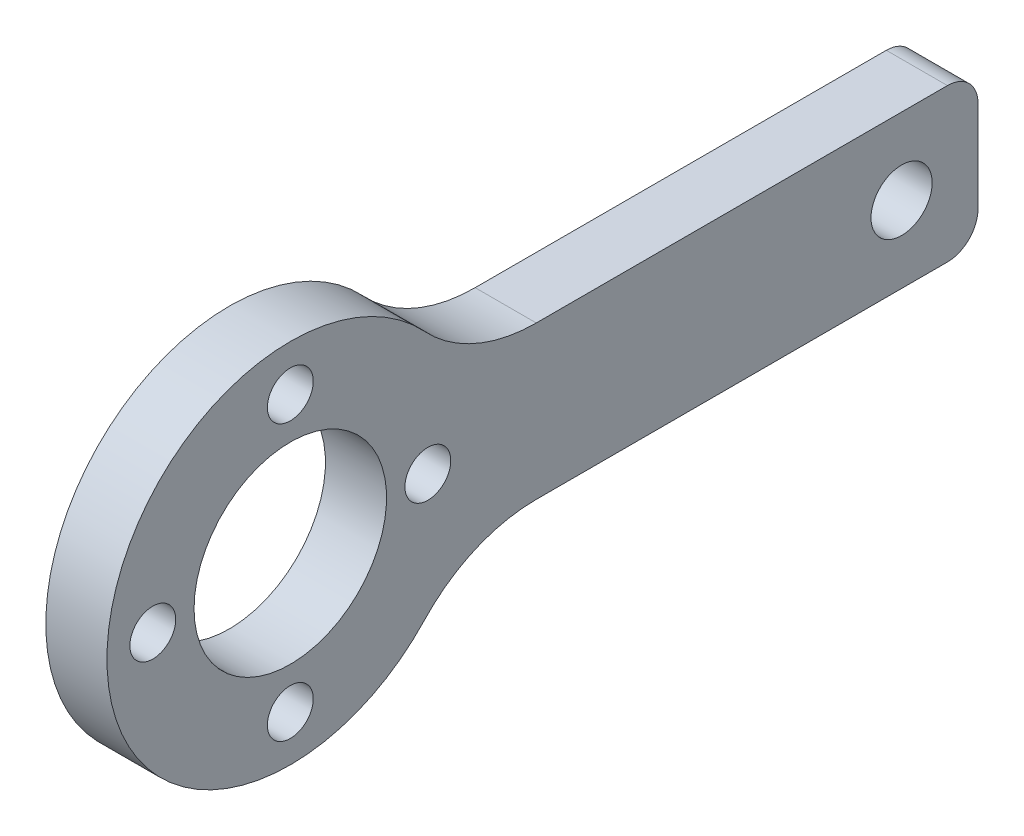
ISO-10303-21;
HEADER;
FILE_DESCRIPTION(('STEP AP214'),'2;1');
FILE_NAME('part.step','',(''),(''),'','','');
FILE_SCHEMA(('AUTOMOTIVE_DESIGN { 1 0 10303 214 1 1 1 1 }'));
ENDSEC;
DATA;
#1=APPLICATION_CONTEXT('core data for automotive mechanical design processes');
#2=APPLICATION_PROTOCOL_DEFINITION('international standard','automotive_design',2000,#1);
#3=PRODUCT_CONTEXT('',#1,'mechanical');
#4=PRODUCT('Part','Part','',(#3));
#5=PRODUCT_RELATED_PRODUCT_CATEGORY('part','',(#4));
#6=PRODUCT_DEFINITION_FORMATION('','',#4);
#7=PRODUCT_DEFINITION_CONTEXT('part definition',#1,'design');
#8=PRODUCT_DEFINITION('design','',#6,#7);
#9=PRODUCT_DEFINITION_SHAPE('','',#8);
#10=(LENGTH_UNIT() NAMED_UNIT(*) SI_UNIT(.MILLI.,.METRE.));
#11=(NAMED_UNIT(*) PLANE_ANGLE_UNIT() SI_UNIT($,.RADIAN.));
#12=(NAMED_UNIT(*) SI_UNIT($,.STERADIAN.) SOLID_ANGLE_UNIT());
#13=UNCERTAINTY_MEASURE_WITH_UNIT(LENGTH_MEASURE(1.E-05),#10,'distance_accuracy_value','');
#14=(GEOMETRIC_REPRESENTATION_CONTEXT(3) GLOBAL_UNCERTAINTY_ASSIGNED_CONTEXT((#13)) GLOBAL_UNIT_ASSIGNED_CONTEXT((#10,
#11,#12)) REPRESENTATION_CONTEXT('',''));
#15=CARTESIAN_POINT('',(0.,0.,0.));
#16=DIRECTION('',(0.,0.,1.));
#17=DIRECTION('',(1.,0.,0.));
#18=AXIS2_PLACEMENT_3D('',#15,#16,#17);
#19=CARTESIAN_POINT('',(4.,0.,0.));
#20=DIRECTION('',(1.,0.,0.));
#21=DIRECTION('',(0.,0.,1.));
#22=AXIS2_PLACEMENT_3D('',#19,#20,#21);
#23=PLANE('',#22);
#24=CARTESIAN_POINT('',(4.,0.,0.));
#25=DIRECTION('',(-1.,0.,0.));
#26=DIRECTION('',(0.,0.,1.));
#27=AXIS2_PLACEMENT_3D('',#24,#25,#26);
#28=CIRCLE('',#27,6.3);
#29=CARTESIAN_POINT('',(4.,0.,6.3));
#30=VERTEX_POINT('',#29);
#31=EDGE_CURVE('E205',#30,#30,#28,.T.);
#32=ORIENTED_EDGE('',*,*,#31,.T.);
#33=EDGE_LOOP('',(#32));
#34=FACE_BOUND('',#33,.T.);
#35=DIRECTION('',(0.,-1.,0.));
#36=VECTOR('',#35,1.);
#37=CARTESIAN_POINT('',(4.,-5.,-45.));
#38=LINE('',#37,#36);
#39=CARTESIAN_POINT('',(4.,3.,-45.));
#40=VERTEX_POINT('',#39);
#41=CARTESIAN_POINT('',(4.,-3.,-45.));
#42=VERTEX_POINT('',#41);
#43=EDGE_CURVE('E180',#40,#42,#38,.T.);
#44=ORIENTED_EDGE('',*,*,#43,.F.);
#45=CARTESIAN_POINT('',(4.,3.,-43.));
#46=DIRECTION('',(-1.,0.,0.));
#47=DIRECTION('',(0.,0.,1.));
#48=AXIS2_PLACEMENT_3D('',#45,#46,#47);
#49=CIRCLE('',#48,2.);
#50=CARTESIAN_POINT('',(4.,5.,-43.));
#51=VERTEX_POINT('',#50);
#52=EDGE_CURVE('E149',#51,#40,#49,.T.);
#53=ORIENTED_EDGE('',*,*,#52,.F.);
#54=DIRECTION('',(0.,0.,-1.));
#55=VECTOR('',#54,1.);
#56=CARTESIAN_POINT('',(4.,5.,-45.));
#57=LINE('',#56,#55);
#58=CARTESIAN_POINT('',(4.,5.,-16.0934769394311));
#59=VERTEX_POINT('',#58);
#60=EDGE_CURVE('E174',#59,#51,#57,.T.);
#61=ORIENTED_EDGE('',*,*,#60,.F.);
#62=CARTESIAN_POINT('',(4.,15.,-16.0934769394311));
#63=DIRECTION('',(-1.,0.,0.));
#64=DIRECTION('',(0.,0.,1.));
#65=AXIS2_PLACEMENT_3D('',#62,#63,#64);
#66=CIRCLE('',#65,10.);
#67=CARTESIAN_POINT('',(4.,8.18181818181818,-8.77826014878059));
#68=VERTEX_POINT('',#67);
#69=EDGE_CURVE('E122',#68,#59,#66,.F.);
#70=ORIENTED_EDGE('',*,*,#69,.F.);
#71=CARTESIAN_POINT('',(4.,0.,0.));
#72=DIRECTION('',(-1.,0.,0.));
#73=DIRECTION('',(0.,0.,1.));
#74=AXIS2_PLACEMENT_3D('',#71,#72,#73);
#75=CIRCLE('',#74,12.);
#76=CARTESIAN_POINT('',(4.,-8.18181818181818,-8.77826014878059));
#77=VERTEX_POINT('',#76);
#78=EDGE_CURVE('E106',#77,#68,#75,.T.);
#79=ORIENTED_EDGE('',*,*,#78,.F.);
#80=CARTESIAN_POINT('',(4.,-15.,-16.0934769394311));
#81=DIRECTION('',(-1.,0.,0.));
#82=DIRECTION('',(0.,0.,1.));
#83=AXIS2_PLACEMENT_3D('',#80,#81,#82);
#84=CIRCLE('',#83,10.);
#85=CARTESIAN_POINT('',(4.,-5.,-16.0934769394311));
#86=VERTEX_POINT('',#85);
#87=EDGE_CURVE('E117',#86,#77,#84,.F.);
#88=ORIENTED_EDGE('',*,*,#87,.F.);
#89=DIRECTION('',(0.,0.,1.));
#90=VECTOR('',#89,1.);
#91=CARTESIAN_POINT('',(4.,-5.,-45.));
#92=LINE('',#91,#90);
#93=CARTESIAN_POINT('',(4.,-5.,-43.));
#94=VERTEX_POINT('',#93);
#95=EDGE_CURVE('E183',#94,#86,#92,.T.);
#96=ORIENTED_EDGE('',*,*,#95,.F.);
#97=CARTESIAN_POINT('',(4.,-3.,-43.));
#98=DIRECTION('',(-1.,0.,0.));
#99=DIRECTION('',(0.,0.,1.));
#100=AXIS2_PLACEMENT_3D('',#97,#98,#99);
#101=CIRCLE('',#100,2.);
#102=EDGE_CURVE('E152',#42,#94,#101,.T.);
#103=ORIENTED_EDGE('',*,*,#102,.F.);
#104=EDGE_LOOP('',(#44,#53,#61,#70,#79,#88,#96,#103));
#105=FACE_BOUND('',#104,.T.);
#106=CARTESIAN_POINT('',(4.,-9.,-1.8995222061946E-13));
#107=DIRECTION('',(-1.,0.,0.));
#108=DIRECTION('',(0.,0.,1.));
#109=AXIS2_PLACEMENT_3D('',#106,#107,#108);
#110=CIRCLE('',#109,1.5);
#111=CARTESIAN_POINT('',(4.,-9.,1.49999999999981));
#112=VERTEX_POINT('',#111);
#113=EDGE_CURVE('E193',#112,#112,#110,.T.);
#114=ORIENTED_EDGE('',*,*,#113,.T.);
#115=EDGE_LOOP('',(#114));
#116=FACE_BOUND('',#115,.T.);
#117=CARTESIAN_POINT('',(4.,9.,0.));
#118=DIRECTION('',(-1.,0.,0.));
#119=DIRECTION('',(0.,0.,1.));
#120=AXIS2_PLACEMENT_3D('',#117,#118,#119);
#121=CIRCLE('',#120,1.5);
#122=CARTESIAN_POINT('',(4.,9.,1.5));
#123=VERTEX_POINT('',#122);
#124=EDGE_CURVE('E131',#123,#123,#121,.T.);
#125=ORIENTED_EDGE('',*,*,#124,.T.);
#126=EDGE_LOOP('',(#125));
#127=FACE_BOUND('',#126,.T.);
#128=CARTESIAN_POINT('',(4.,-1.61329283265843E-13,9.));
#129=DIRECTION('',(-1.,0.,0.));
#130=DIRECTION('',(0.,0.,1.));
#131=AXIS2_PLACEMENT_3D('',#128,#129,#130);
#132=CIRCLE('',#131,1.5);
#133=CARTESIAN_POINT('',(4.,-1.61329283265843E-13,10.5));
#134=VERTEX_POINT('',#133);
#135=EDGE_CURVE('E199',#134,#134,#132,.T.);
#136=ORIENTED_EDGE('',*,*,#135,.T.);
#137=EDGE_LOOP('',(#136));
#138=FACE_BOUND('',#137,.T.);
#139=CARTESIAN_POINT('',(4.,2.21610924056037E-13,-9.));
#140=DIRECTION('',(-1.,0.,0.));
#141=DIRECTION('',(0.,0.,1.));
#142=AXIS2_PLACEMENT_3D('',#139,#140,#141);
#143=CIRCLE('',#142,1.5);
#144=CARTESIAN_POINT('',(4.,2.21610924056037E-13,-7.5));
#145=VERTEX_POINT('',#144);
#146=EDGE_CURVE('E186',#145,#145,#143,.T.);
#147=ORIENTED_EDGE('',*,*,#146,.T.);
#148=EDGE_LOOP('',(#147));
#149=FACE_BOUND('',#148,.T.);
#150=CARTESIAN_POINT('',(4.,0.,-40.));
#151=DIRECTION('',(-1.,0.,0.));
#152=DIRECTION('',(0.,0.,1.));
#153=AXIS2_PLACEMENT_3D('',#150,#151,#152);
#154=CIRCLE('',#153,2.);
#155=CARTESIAN_POINT('',(4.,0.,-38.));
#156=VERTEX_POINT('',#155);
#157=EDGE_CURVE('E177',#156,#156,#154,.T.);
#158=ORIENTED_EDGE('',*,*,#157,.T.);
#159=EDGE_LOOP('',(#158));
#160=FACE_BOUND('',#159,.T.);
#161=ADVANCED_FACE('F37',(#34,#105,#116,#127,#138,#149,#160),#23,.T.);
#162=CARTESIAN_POINT('',(0.,0.,0.));
#163=DIRECTION('',(1.,0.,0.));
#164=DIRECTION('',(0.,0.,1.));
#165=AXIS2_PLACEMENT_3D('',#162,#163,#164);
#166=PLANE('',#165);
#167=CARTESIAN_POINT('',(0.,0.,0.));
#168=DIRECTION('',(-1.,0.,0.));
#169=DIRECTION('',(0.,0.,1.));
#170=AXIS2_PLACEMENT_3D('',#167,#168,#169);
#171=CIRCLE('',#170,6.3);
#172=CARTESIAN_POINT('',(0.,0.,6.3));
#173=VERTEX_POINT('',#172);
#174=EDGE_CURVE('E202',#173,#173,#171,.T.);
#175=ORIENTED_EDGE('',*,*,#174,.F.);
#176=EDGE_LOOP('',(#175));
#177=FACE_BOUND('',#176,.T.);
#178=CARTESIAN_POINT('',(0.,9.,0.));
#179=DIRECTION('',(-1.,0.,0.));
#180=DIRECTION('',(0.,0.,1.));
#181=AXIS2_PLACEMENT_3D('',#178,#179,#180);
#182=CIRCLE('',#181,1.5);
#183=CARTESIAN_POINT('',(0.,9.,1.5));
#184=VERTEX_POINT('',#183);
#185=EDGE_CURVE('E134',#184,#184,#182,.T.);
#186=ORIENTED_EDGE('',*,*,#185,.F.);
#187=EDGE_LOOP('',(#186));
#188=FACE_BOUND('',#187,.T.);
#189=DIRECTION('',(0.,0.,-1.));
#190=VECTOR('',#189,1.);
#191=CARTESIAN_POINT('',(0.,-5.,-45.));
#192=LINE('',#191,#190);
#193=CARTESIAN_POINT('',(0.,-5.,-16.0934769394311));
#194=VERTEX_POINT('',#193);
#195=CARTESIAN_POINT('',(0.,-5.,-43.));
#196=VERTEX_POINT('',#195);
#197=EDGE_CURVE('E169',#194,#196,#192,.T.);
#198=ORIENTED_EDGE('',*,*,#197,.F.);
#199=CARTESIAN_POINT('',(0.,-15.,-16.0934769394311));
#200=DIRECTION('',(-1.,0.,0.));
#201=DIRECTION('',(0.,0.,1.));
#202=AXIS2_PLACEMENT_3D('',#199,#200,#201);
#203=CIRCLE('',#202,10.);
#204=CARTESIAN_POINT('',(0.,-8.18181818181818,-8.77826014878059));
#205=VERTEX_POINT('',#204);
#206=EDGE_CURVE('E123',#205,#194,#203,.T.);
#207=ORIENTED_EDGE('',*,*,#206,.F.);
#208=CARTESIAN_POINT('',(0.,0.,0.));
#209=DIRECTION('',(-1.,0.,0.));
#210=DIRECTION('',(0.,0.,1.));
#211=AXIS2_PLACEMENT_3D('',#208,#209,#210);
#212=CIRCLE('',#211,12.);
#213=CARTESIAN_POINT('',(0.,8.18181818181818,-8.77826014878059));
#214=VERTEX_POINT('',#213);
#215=EDGE_CURVE('E109',#205,#214,#212,.T.);
#216=ORIENTED_EDGE('',*,*,#215,.T.);
#217=CARTESIAN_POINT('',(0.,15.,-16.0934769394311));
#218=DIRECTION('',(-1.,0.,0.));
#219=DIRECTION('',(0.,0.,1.));
#220=AXIS2_PLACEMENT_3D('',#217,#218,#219);
#221=CIRCLE('',#220,10.);
#222=CARTESIAN_POINT('',(0.,5.,-16.0934769394311));
#223=VERTEX_POINT('',#222);
#224=EDGE_CURVE('E142',#223,#214,#221,.T.);
#225=ORIENTED_EDGE('',*,*,#224,.F.);
#226=DIRECTION('',(0.,0.,1.));
#227=VECTOR('',#226,1.);
#228=CARTESIAN_POINT('',(0.,5.,-45.));
#229=LINE('',#228,#227);
#230=CARTESIAN_POINT('',(0.,5.,-43.));
#231=VERTEX_POINT('',#230);
#232=EDGE_CURVE('E170',#231,#223,#229,.T.);
#233=ORIENTED_EDGE('',*,*,#232,.F.);
#234=CARTESIAN_POINT('',(0.,3.,-43.));
#235=DIRECTION('',(-1.,0.,0.));
#236=DIRECTION('',(0.,0.,1.));
#237=AXIS2_PLACEMENT_3D('',#234,#235,#236);
#238=CIRCLE('',#237,2.);
#239=CARTESIAN_POINT('',(0.,3.,-45.));
#240=VERTEX_POINT('',#239);
#241=EDGE_CURVE('E155',#240,#231,#238,.F.);
#242=ORIENTED_EDGE('',*,*,#241,.F.);
#243=DIRECTION('',(0.,1.,0.));
#244=VECTOR('',#243,1.);
#245=CARTESIAN_POINT('',(0.,-5.,-45.));
#246=LINE('',#245,#244);
#247=CARTESIAN_POINT('',(0.,-3.,-45.));
#248=VERTEX_POINT('',#247);
#249=EDGE_CURVE('E164',#248,#240,#246,.T.);
#250=ORIENTED_EDGE('',*,*,#249,.F.);
#251=CARTESIAN_POINT('',(0.,-3.,-43.));
#252=DIRECTION('',(-1.,0.,0.));
#253=DIRECTION('',(0.,0.,1.));
#254=AXIS2_PLACEMENT_3D('',#251,#252,#253);
#255=CIRCLE('',#254,2.);
#256=EDGE_CURVE('E45',#196,#248,#255,.F.);
#257=ORIENTED_EDGE('',*,*,#256,.F.);
#258=EDGE_LOOP('',(#198,#207,#216,#225,#233,#242,#250,#257));
#259=FACE_BOUND('',#258,.T.);
#260=CARTESIAN_POINT('',(0.,-1.61329283265843E-13,9.));
#261=DIRECTION('',(-1.,0.,0.));
#262=DIRECTION('',(0.,0.,1.));
#263=AXIS2_PLACEMENT_3D('',#260,#261,#262);
#264=CIRCLE('',#263,1.5);
#265=CARTESIAN_POINT('',(0.,-1.61329283265843E-13,10.5));
#266=VERTEX_POINT('',#265);
#267=EDGE_CURVE('E196',#266,#266,#264,.T.);
#268=ORIENTED_EDGE('',*,*,#267,.F.);
#269=EDGE_LOOP('',(#268));
#270=FACE_BOUND('',#269,.T.);
#271=CARTESIAN_POINT('',(0.,-9.,-1.8995222061946E-13));
#272=DIRECTION('',(-1.,0.,0.));
#273=DIRECTION('',(0.,0.,1.));
#274=AXIS2_PLACEMENT_3D('',#271,#272,#273);
#275=CIRCLE('',#274,1.5);
#276=CARTESIAN_POINT('',(0.,-9.,1.49999999999981));
#277=VERTEX_POINT('',#276);
#278=EDGE_CURVE('E189',#277,#277,#275,.T.);
#279=ORIENTED_EDGE('',*,*,#278,.F.);
#280=EDGE_LOOP('',(#279));
#281=FACE_BOUND('',#280,.T.);
#282=CARTESIAN_POINT('',(0.,2.21610924056037E-13,-9.));
#283=DIRECTION('',(-1.,0.,0.));
#284=DIRECTION('',(0.,0.,1.));
#285=AXIS2_PLACEMENT_3D('',#282,#283,#284);
#286=CIRCLE('',#285,1.5);
#287=CARTESIAN_POINT('',(0.,2.21610924056037E-13,-7.5));
#288=VERTEX_POINT('',#287);
#289=EDGE_CURVE('E190',#288,#288,#286,.T.);
#290=ORIENTED_EDGE('',*,*,#289,.F.);
#291=EDGE_LOOP('',(#290));
#292=FACE_BOUND('',#291,.T.);
#293=CARTESIAN_POINT('',(0.,0.,-40.));
#294=DIRECTION('',(-1.,0.,0.));
#295=DIRECTION('',(0.,0.,1.));
#296=AXIS2_PLACEMENT_3D('',#293,#294,#295);
#297=CIRCLE('',#296,2.);
#298=CARTESIAN_POINT('',(0.,0.,-38.));
#299=VERTEX_POINT('',#298);
#300=EDGE_CURVE('E172',#299,#299,#297,.F.);
#301=ORIENTED_EDGE('',*,*,#300,.T.);
#302=EDGE_LOOP('',(#301));
#303=FACE_BOUND('',#302,.T.);
#304=ADVANCED_FACE('F165',(#177,#188,#259,#270,#281,#292,#303),#166,.F.);
#305=CARTESIAN_POINT('',(4.,0.,0.));
#306=DIRECTION('',(-1.,0.,0.));
#307=DIRECTION('',(0.,0.,-1.));
#308=AXIS2_PLACEMENT_3D('',#305,#306,#307);
#309=CYLINDRICAL_SURFACE('',#308,12.);
#310=ORIENTED_EDGE('',*,*,#78,.T.);
#311=DIRECTION('',(-1.,0.,0.));
#312=VECTOR('',#311,1.);
#313=CARTESIAN_POINT('',(4.,8.18181818181818,-8.77826014878059));
#314=LINE('',#313,#312);
#315=EDGE_CURVE('E114',#214,#68,#314,.F.);
#316=ORIENTED_EDGE('',*,*,#315,.F.);
#317=ORIENTED_EDGE('',*,*,#215,.F.);
#318=DIRECTION('',(-1.,0.,0.));
#319=VECTOR('',#318,1.);
#320=CARTESIAN_POINT('',(4.,-8.18181818181818,-8.77826014878059));
#321=LINE('',#320,#319);
#322=EDGE_CURVE('E102',#77,#205,#321,.T.);
#323=ORIENTED_EDGE('',*,*,#322,.F.);
#324=EDGE_LOOP('',(#310,#316,#317,#323));
#325=FACE_BOUND('',#324,.T.);
#326=ADVANCED_FACE('F104',(#325),#309,.T.);
#327=CARTESIAN_POINT('',(4.,9.,0.));
#328=DIRECTION('',(-1.,0.,0.));
#329=DIRECTION('',(0.,0.,-1.));
#330=AXIS2_PLACEMENT_3D('',#327,#328,#329);
#331=CYLINDRICAL_SURFACE('',#330,1.5);
#332=ORIENTED_EDGE('',*,*,#124,.F.);
#333=EDGE_LOOP('',(#332));
#334=FACE_BOUND('',#333,.T.);
#335=ORIENTED_EDGE('',*,*,#185,.T.);
#336=EDGE_LOOP('',(#335));
#337=FACE_BOUND('',#336,.T.);
#338=ADVANCED_FACE('F215',(#334,#337),#331,.F.);
#339=CARTESIAN_POINT('',(4.,0.,0.));
#340=DIRECTION('',(-1.,0.,0.));
#341=DIRECTION('',(0.,0.,-1.));
#342=AXIS2_PLACEMENT_3D('',#339,#340,#341);
#343=CYLINDRICAL_SURFACE('',#342,6.3);
#344=ORIENTED_EDGE('',*,*,#31,.F.);
#345=EDGE_LOOP('',(#344));
#346=FACE_BOUND('',#345,.T.);
#347=ORIENTED_EDGE('',*,*,#174,.T.);
#348=EDGE_LOOP('',(#347));
#349=FACE_BOUND('',#348,.T.);
#350=ADVANCED_FACE('F270',(#346,#349),#343,.F.);
#351=CARTESIAN_POINT('',(4.,-1.61329283265843E-13,9.));
#352=DIRECTION('',(-1.,0.,0.));
#353=DIRECTION('',(0.,0.,-1.));
#354=AXIS2_PLACEMENT_3D('',#351,#352,#353);
#355=CYLINDRICAL_SURFACE('',#354,1.5);
#356=ORIENTED_EDGE('',*,*,#135,.F.);
#357=EDGE_LOOP('',(#356));
#358=FACE_BOUND('',#357,.T.);
#359=ORIENTED_EDGE('',*,*,#267,.T.);
#360=EDGE_LOOP('',(#359));
#361=FACE_BOUND('',#360,.T.);
#362=ADVANCED_FACE('F266',(#358,#361),#355,.F.);
#363=CARTESIAN_POINT('',(4.,-9.,-1.8995222061946E-13));
#364=DIRECTION('',(-1.,0.,0.));
#365=DIRECTION('',(0.,0.,-1.));
#366=AXIS2_PLACEMENT_3D('',#363,#364,#365);
#367=CYLINDRICAL_SURFACE('',#366,1.5);
#368=ORIENTED_EDGE('',*,*,#113,.F.);
#369=EDGE_LOOP('',(#368));
#370=FACE_BOUND('',#369,.T.);
#371=ORIENTED_EDGE('',*,*,#278,.T.);
#372=EDGE_LOOP('',(#371));
#373=FACE_BOUND('',#372,.T.);
#374=ADVANCED_FACE('F262',(#370,#373),#367,.F.);
#375=CARTESIAN_POINT('',(4.,2.21610924056037E-13,-9.));
#376=DIRECTION('',(-1.,0.,0.));
#377=DIRECTION('',(0.,0.,-1.));
#378=AXIS2_PLACEMENT_3D('',#375,#376,#377);
#379=CYLINDRICAL_SURFACE('',#378,1.5);
#380=ORIENTED_EDGE('',*,*,#146,.F.);
#381=EDGE_LOOP('',(#380));
#382=FACE_BOUND('',#381,.T.);
#383=ORIENTED_EDGE('',*,*,#289,.T.);
#384=EDGE_LOOP('',(#383));
#385=FACE_BOUND('',#384,.T.);
#386=ADVANCED_FACE('F259',(#382,#385),#379,.F.);
#387=CARTESIAN_POINT('',(-41.2310562561766,-5.,-45.));
#388=DIRECTION('',(0.,-1.,0.));
#389=DIRECTION('',(0.,0.,1.));
#390=AXIS2_PLACEMENT_3D('',#387,#388,#389);
#391=PLANE('',#390);
#392=ORIENTED_EDGE('',*,*,#95,.T.);
#393=DIRECTION('',(-1.,0.,0.));
#394=VECTOR('',#393,1.);
#395=CARTESIAN_POINT('',(-41.2310562561766,-5.,-16.0934769394311));
#396=LINE('',#395,#394);
#397=EDGE_CURVE('E113',#194,#86,#396,.F.);
#398=ORIENTED_EDGE('',*,*,#397,.F.);
#399=ORIENTED_EDGE('',*,*,#197,.T.);
#400=DIRECTION('',(1.,0.,0.));
#401=VECTOR('',#400,1.);
#402=CARTESIAN_POINT('',(-41.2310562561766,-5.,-43.));
#403=LINE('',#402,#401);
#404=EDGE_CURVE('E58',#94,#196,#403,.F.);
#405=ORIENTED_EDGE('',*,*,#404,.F.);
#406=EDGE_LOOP('',(#392,#398,#399,#405));
#407=FACE_BOUND('',#406,.T.);
#408=ADVANCED_FACE('F255',(#407),#391,.T.);
#409=CARTESIAN_POINT('',(-41.2310562561766,5.,-45.));
#410=DIRECTION('',(0.,1.,0.));
#411=DIRECTION('',(0.,0.,-1.));
#412=AXIS2_PLACEMENT_3D('',#409,#410,#411);
#413=PLANE('',#412);
#414=ORIENTED_EDGE('',*,*,#232,.T.);
#415=DIRECTION('',(-1.,0.,0.));
#416=VECTOR('',#415,1.);
#417=CARTESIAN_POINT('',(-41.2310562561766,5.,-16.0934769394311));
#418=LINE('',#417,#416);
#419=EDGE_CURVE('E138',#59,#223,#418,.T.);
#420=ORIENTED_EDGE('',*,*,#419,.F.);
#421=ORIENTED_EDGE('',*,*,#60,.T.);
#422=DIRECTION('',(1.,0.,0.));
#423=VECTOR('',#422,1.);
#424=CARTESIAN_POINT('',(-41.2310562561766,5.,-43.));
#425=LINE('',#424,#423);
#426=EDGE_CURVE('E11',#231,#51,#425,.T.);
#427=ORIENTED_EDGE('',*,*,#426,.F.);
#428=EDGE_LOOP('',(#414,#420,#421,#427));
#429=FACE_BOUND('',#428,.T.);
#430=ADVANCED_FACE('F244',(#429),#413,.T.);
#431=CARTESIAN_POINT('',(-41.2310562561766,-5.,-45.));
#432=DIRECTION('',(0.,0.,-1.));
#433=DIRECTION('',(1.,0.,0.));
#434=AXIS2_PLACEMENT_3D('',#431,#432,#433);
#435=PLANE('',#434);
#436=ORIENTED_EDGE('',*,*,#249,.T.);
#437=DIRECTION('',(1.,0.,0.));
#438=VECTOR('',#437,1.);
#439=CARTESIAN_POINT('',(-41.2310562561766,3.,-45.));
#440=LINE('',#439,#438);
#441=EDGE_CURVE('E145',#40,#240,#440,.F.);
#442=ORIENTED_EDGE('',*,*,#441,.F.);
#443=ORIENTED_EDGE('',*,*,#43,.T.);
#444=DIRECTION('',(1.,0.,0.));
#445=VECTOR('',#444,1.);
#446=CARTESIAN_POINT('',(-41.2310562561766,-3.,-45.));
#447=LINE('',#446,#445);
#448=EDGE_CURVE('E147',#248,#42,#447,.T.);
#449=ORIENTED_EDGE('',*,*,#448,.F.);
#450=EDGE_LOOP('',(#436,#442,#443,#449));
#451=FACE_BOUND('',#450,.T.);
#452=ADVANCED_FACE('F246',(#451),#435,.T.);
#453=CARTESIAN_POINT('',(-41.2310562561766,0.,-40.));
#454=DIRECTION('',(1.,0.,0.));
#455=DIRECTION('',(0.,0.,1.));
#456=AXIS2_PLACEMENT_3D('',#453,#454,#455);
#457=CYLINDRICAL_SURFACE('',#456,2.);
#458=ORIENTED_EDGE('',*,*,#300,.F.);
#459=EDGE_LOOP('',(#458));
#460=FACE_BOUND('',#459,.T.);
#461=ORIENTED_EDGE('',*,*,#157,.F.);
#462=EDGE_LOOP('',(#461));
#463=FACE_BOUND('',#462,.T.);
#464=ADVANCED_FACE('F233',(#460,#463),#457,.F.);
#465=CARTESIAN_POINT('',(4.,-15.,-16.0934769394311));
#466=DIRECTION('',(-1.,0.,0.));
#467=DIRECTION('',(0.,0.,-1.));
#468=AXIS2_PLACEMENT_3D('',#465,#466,#467);
#469=CYLINDRICAL_SURFACE('',#468,10.);
#470=ORIENTED_EDGE('',*,*,#87,.T.);
#471=ORIENTED_EDGE('',*,*,#322,.T.);
#472=ORIENTED_EDGE('',*,*,#206,.T.);
#473=ORIENTED_EDGE('',*,*,#397,.T.);
#474=EDGE_LOOP('',(#470,#471,#472,#473));
#475=FACE_BOUND('',#474,.T.);
#476=ADVANCED_FACE('F118',(#475),#469,.F.);
#477=CARTESIAN_POINT('',(4.,15.,-16.0934769394311));
#478=DIRECTION('',(-1.,0.,0.));
#479=DIRECTION('',(0.,0.,-1.));
#480=AXIS2_PLACEMENT_3D('',#477,#478,#479);
#481=CYLINDRICAL_SURFACE('',#480,10.);
#482=ORIENTED_EDGE('',*,*,#224,.T.);
#483=ORIENTED_EDGE('',*,*,#315,.T.);
#484=ORIENTED_EDGE('',*,*,#69,.T.);
#485=ORIENTED_EDGE('',*,*,#419,.T.);
#486=EDGE_LOOP('',(#482,#483,#484,#485));
#487=FACE_BOUND('',#486,.T.);
#488=ADVANCED_FACE('F232',(#487),#481,.F.);
#489=CARTESIAN_POINT('',(-41.2310562561766,-3.,-43.));
#490=DIRECTION('',(1.,0.,0.));
#491=DIRECTION('',(0.,0.,1.));
#492=AXIS2_PLACEMENT_3D('',#489,#490,#491);
#493=CYLINDRICAL_SURFACE('',#492,2.);
#494=ORIENTED_EDGE('',*,*,#256,.T.);
#495=ORIENTED_EDGE('',*,*,#448,.T.);
#496=ORIENTED_EDGE('',*,*,#102,.T.);
#497=ORIENTED_EDGE('',*,*,#404,.T.);
#498=EDGE_LOOP('',(#494,#495,#496,#497));
#499=FACE_BOUND('',#498,.T.);
#500=ADVANCED_FACE('F157',(#499),#493,.T.);
#501=CARTESIAN_POINT('',(-41.2310562561766,3.,-43.));
#502=DIRECTION('',(1.,0.,0.));
#503=DIRECTION('',(0.,0.,1.));
#504=AXIS2_PLACEMENT_3D('',#501,#502,#503);
#505=CYLINDRICAL_SURFACE('',#504,2.);
#506=ORIENTED_EDGE('',*,*,#241,.T.);
#507=ORIENTED_EDGE('',*,*,#426,.T.);
#508=ORIENTED_EDGE('',*,*,#52,.T.);
#509=ORIENTED_EDGE('',*,*,#441,.T.);
#510=EDGE_LOOP('',(#506,#507,#508,#509));
#511=FACE_BOUND('',#510,.T.);
#512=ADVANCED_FACE('F39',(#511),#505,.T.);
#513=CLOSED_SHELL('',(#161,#304,#326,#338,#350,#362,#374,#386,#408,#430,#452,#464,#476,#488,
#500,#512));
#514=MANIFOLD_SOLID_BREP('B2',#513);
#515=ADVANCED_BREP_SHAPE_REPRESENTATION('',(#18,#514),#14);
#516=SHAPE_DEFINITION_REPRESENTATION(#9,#515);
ENDSEC;
END-ISO-10303-21;
